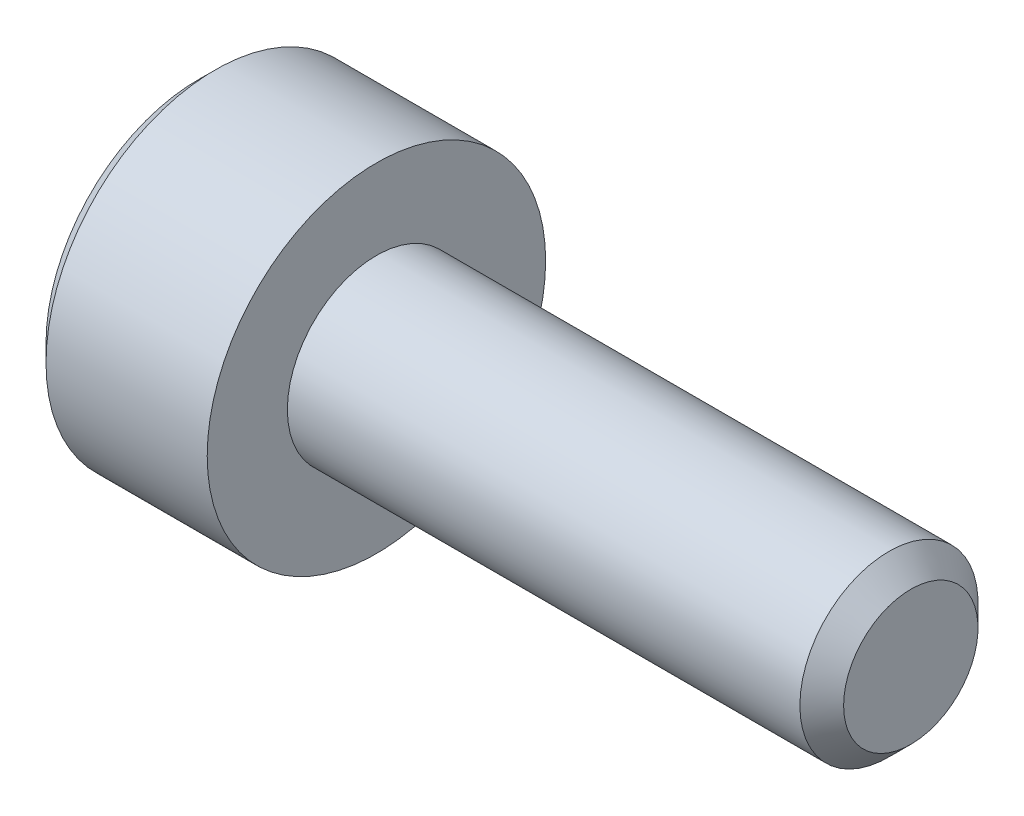
ISO-10303-21;
HEADER;
FILE_DESCRIPTION(('STEP AP214'),'2;1');
FILE_NAME('part.step','',(''),(''),'','','');
FILE_SCHEMA(('AUTOMOTIVE_DESIGN { 1 0 10303 214 1 1 1 1 }'));
ENDSEC;
DATA;
#1=APPLICATION_CONTEXT('core data for automotive mechanical design processes');
#2=APPLICATION_PROTOCOL_DEFINITION('international standard','automotive_design',2000,#1);
#3=PRODUCT_CONTEXT('',#1,'mechanical');
#4=PRODUCT('Part','Part','',(#3));
#5=PRODUCT_RELATED_PRODUCT_CATEGORY('part','',(#4));
#6=PRODUCT_DEFINITION_FORMATION('','',#4);
#7=PRODUCT_DEFINITION_CONTEXT('part definition',#1,'design');
#8=PRODUCT_DEFINITION('design','',#6,#7);
#9=PRODUCT_DEFINITION_SHAPE('','',#8);
#10=(LENGTH_UNIT() NAMED_UNIT(*) SI_UNIT(.MILLI.,.METRE.));
#11=(NAMED_UNIT(*) PLANE_ANGLE_UNIT() SI_UNIT($,.RADIAN.));
#12=(NAMED_UNIT(*) SI_UNIT($,.STERADIAN.) SOLID_ANGLE_UNIT());
#13=UNCERTAINTY_MEASURE_WITH_UNIT(LENGTH_MEASURE(1.E-05),#10,'distance_accuracy_value','');
#14=(GEOMETRIC_REPRESENTATION_CONTEXT(3) GLOBAL_UNCERTAINTY_ASSIGNED_CONTEXT((#13)) GLOBAL_UNIT_ASSIGNED_CONTEXT((#10,
#11,#12)) REPRESENTATION_CONTEXT('',''));
#15=CARTESIAN_POINT('',(0.,0.,0.));
#16=DIRECTION('',(0.,0.,1.));
#17=DIRECTION('',(1.,0.,0.));
#18=AXIS2_PLACEMENT_3D('',#15,#16,#17);
#19=CARTESIAN_POINT('',(-2.,0.,0.));
#20=DIRECTION('',(1.,0.,0.));
#21=DIRECTION('',(0.,0.,-1.));
#22=AXIS2_PLACEMENT_3D('',#19,#20,#21);
#23=PLANE('',#22);
#24=CARTESIAN_POINT('',(-2.,0.,0.));
#25=DIRECTION('',(-1.,0.,0.));
#26=DIRECTION('',(0.,0.,1.));
#27=AXIS2_PLACEMENT_3D('',#24,#25,#26);
#28=CIRCLE('',#27,1.71);
#29=CARTESIAN_POINT('',(-2.,0.,1.71));
#30=VERTEX_POINT('',#29);
#31=EDGE_CURVE('E11',#30,#30,#28,.T.);
#32=ORIENTED_EDGE('',*,*,#31,.T.);
#33=EDGE_LOOP('',(#32));
#34=FACE_BOUND('',#33,.T.);
#35=DIRECTION('',(0.,-1.,0.));
#36=VECTOR('',#35,1.);
#37=CARTESIAN_POINT('',(-2.,0.43301270189222,0.75));
#38=LINE('',#37,#36);
#39=CARTESIAN_POINT('',(-2.,0.43301270189222,0.75));
#40=VERTEX_POINT('',#39);
#41=CARTESIAN_POINT('',(-2.,-0.43301270189222,0.75));
#42=VERTEX_POINT('',#41);
#43=EDGE_CURVE('E52',#40,#42,#38,.T.);
#44=ORIENTED_EDGE('',*,*,#43,.T.);
#45=DIRECTION('',(0.,-0.500000000000001,-0.866025403784438));
#46=VECTOR('',#45,1.);
#47=CARTESIAN_POINT('',(-2.,-0.43301270189222,0.75));
#48=LINE('',#47,#46);
#49=CARTESIAN_POINT('',(-2.,-0.86602540378444,0.));
#50=VERTEX_POINT('',#49);
#51=EDGE_CURVE('E123',#42,#50,#48,.T.);
#52=ORIENTED_EDGE('',*,*,#51,.T.);
#53=DIRECTION('',(0.,0.500000000000001,-0.866025403784438));
#54=VECTOR('',#53,1.);
#55=CARTESIAN_POINT('',(-2.,-0.86602540378444,0.));
#56=LINE('',#55,#54);
#57=CARTESIAN_POINT('',(-2.,-0.43301270189222,-0.75));
#58=VERTEX_POINT('',#57);
#59=EDGE_CURVE('E126',#50,#58,#56,.T.);
#60=ORIENTED_EDGE('',*,*,#59,.T.);
#61=DIRECTION('',(0.,1.,0.));
#62=VECTOR('',#61,1.);
#63=CARTESIAN_POINT('',(-2.,-0.43301270189222,-0.75));
#64=LINE('',#63,#62);
#65=CARTESIAN_POINT('',(-2.,0.43301270189222,-0.75));
#66=VERTEX_POINT('',#65);
#67=EDGE_CURVE('E129',#58,#66,#64,.T.);
#68=ORIENTED_EDGE('',*,*,#67,.T.);
#69=DIRECTION('',(0.,0.500000000000001,0.866025403784438));
#70=VECTOR('',#69,1.);
#71=CARTESIAN_POINT('',(-2.,0.43301270189222,-0.75));
#72=LINE('',#71,#70);
#73=CARTESIAN_POINT('',(-2.,0.86602540378444,0.));
#74=VERTEX_POINT('',#73);
#75=EDGE_CURVE('E113',#66,#74,#72,.T.);
#76=ORIENTED_EDGE('',*,*,#75,.T.);
#77=DIRECTION('',(0.,-0.500000000000001,0.866025403784438));
#78=VECTOR('',#77,1.);
#79=CARTESIAN_POINT('',(-2.,0.86602540378444,0.));
#80=LINE('',#79,#78);
#81=EDGE_CURVE('E132',#74,#40,#80,.T.);
#82=ORIENTED_EDGE('',*,*,#81,.T.);
#83=EDGE_LOOP('',(#44,#52,#60,#68,#76,#82));
#84=FACE_BOUND('',#83,.T.);
#85=ADVANCED_FACE('F38',(#34,#84),#23,.F.);
#86=CARTESIAN_POINT('',(-1.81,0.,0.));
#87=DIRECTION('',(1.,0.,0.));
#88=DIRECTION('',(0.,0.,-1.));
#89=AXIS2_PLACEMENT_3D('',#86,#87,#88);
#90=CONICAL_SURFACE('',#89,1.9,0.785398163397448);
#91=ORIENTED_EDGE('',*,*,#31,.F.);
#92=EDGE_LOOP('',(#91));
#93=FACE_BOUND('',#92,.T.);
#94=CARTESIAN_POINT('',(-1.81,0.,0.));
#95=DIRECTION('',(-1.,0.,0.));
#96=DIRECTION('',(0.,0.,1.));
#97=AXIS2_PLACEMENT_3D('',#94,#95,#96);
#98=CIRCLE('',#97,1.9);
#99=CARTESIAN_POINT('',(-1.81,0.,1.9));
#100=VERTEX_POINT('',#99);
#101=EDGE_CURVE('E45',#100,#100,#98,.T.);
#102=ORIENTED_EDGE('',*,*,#101,.T.);
#103=EDGE_LOOP('',(#102));
#104=FACE_BOUND('',#103,.T.);
#105=ADVANCED_FACE('F157',(#93,#104),#90,.T.);
#106=CARTESIAN_POINT('',(6.,0.,0.));
#107=DIRECTION('',(-1.,0.,0.));
#108=DIRECTION('',(0.,0.,1.));
#109=AXIS2_PLACEMENT_3D('',#106,#107,#108);
#110=CYLINDRICAL_SURFACE('',#109,1.9);
#111=ORIENTED_EDGE('',*,*,#101,.F.);
#112=EDGE_LOOP('',(#111));
#113=FACE_BOUND('',#112,.T.);
#114=CARTESIAN_POINT('',(0.,0.,0.));
#115=DIRECTION('',(-1.,0.,0.));
#116=DIRECTION('',(0.,0.,1.));
#117=AXIS2_PLACEMENT_3D('',#114,#115,#116);
#118=CIRCLE('',#117,1.9);
#119=CARTESIAN_POINT('',(0.,0.,1.9));
#120=VERTEX_POINT('',#119);
#121=EDGE_CURVE('E152',#120,#120,#118,.T.);
#122=ORIENTED_EDGE('',*,*,#121,.T.);
#123=EDGE_LOOP('',(#122));
#124=FACE_BOUND('',#123,.T.);
#125=ADVANCED_FACE('F159',(#113,#124),#110,.T.);
#126=CARTESIAN_POINT('',(0.,1.9,0.));
#127=DIRECTION('',(-1.,0.,0.));
#128=DIRECTION('',(0.,0.,1.));
#129=AXIS2_PLACEMENT_3D('',#126,#127,#128);
#130=PLANE('',#129);
#131=ORIENTED_EDGE('',*,*,#121,.F.);
#132=EDGE_LOOP('',(#131));
#133=FACE_BOUND('',#132,.T.);
#134=CARTESIAN_POINT('',(0.,0.,0.));
#135=DIRECTION('',(-1.,0.,0.));
#136=DIRECTION('',(0.,0.,1.));
#137=AXIS2_PLACEMENT_3D('',#134,#135,#136);
#138=CIRCLE('',#137,1.);
#139=CARTESIAN_POINT('',(0.,0.,1.));
#140=VERTEX_POINT('',#139);
#141=EDGE_CURVE('E149',#140,#140,#138,.T.);
#142=ORIENTED_EDGE('',*,*,#141,.T.);
#143=EDGE_LOOP('',(#142));
#144=FACE_BOUND('',#143,.T.);
#145=ADVANCED_FACE('F162',(#133,#144),#130,.F.);
#146=CARTESIAN_POINT('',(6.,0.,0.));
#147=DIRECTION('',(-1.,0.,0.));
#148=DIRECTION('',(0.,0.,1.));
#149=AXIS2_PLACEMENT_3D('',#146,#147,#148);
#150=CYLINDRICAL_SURFACE('',#149,1.);
#151=ORIENTED_EDGE('',*,*,#141,.F.);
#152=EDGE_LOOP('',(#151));
#153=FACE_BOUND('',#152,.T.);
#154=CARTESIAN_POINT('',(5.7545,0.,0.));
#155=DIRECTION('',(-1.,0.,0.));
#156=DIRECTION('',(0.,0.,1.));
#157=AXIS2_PLACEMENT_3D('',#154,#155,#156);
#158=CIRCLE('',#157,1.);
#159=CARTESIAN_POINT('',(5.7545,0.,1.));
#160=VERTEX_POINT('',#159);
#161=EDGE_CURVE('E146',#160,#160,#158,.T.);
#162=ORIENTED_EDGE('',*,*,#161,.T.);
#163=EDGE_LOOP('',(#162));
#164=FACE_BOUND('',#163,.T.);
#165=ADVANCED_FACE('F168',(#153,#164),#150,.T.);
#166=CARTESIAN_POINT('',(6.,0.,0.));
#167=DIRECTION('',(-1.,0.,0.));
#168=DIRECTION('',(0.,0.,1.));
#169=AXIS2_PLACEMENT_3D('',#166,#167,#168);
#170=CONICAL_SURFACE('',#169,0.7545,0.785398163397448);
#171=ORIENTED_EDGE('',*,*,#161,.F.);
#172=EDGE_LOOP('',(#171));
#173=FACE_BOUND('',#172,.T.);
#174=CARTESIAN_POINT('',(6.,0.,0.));
#175=DIRECTION('',(-1.,0.,0.));
#176=DIRECTION('',(0.,0.,1.));
#177=AXIS2_PLACEMENT_3D('',#174,#175,#176);
#178=CIRCLE('',#177,0.7545);
#179=CARTESIAN_POINT('',(6.,0.,0.7545));
#180=VERTEX_POINT('',#179);
#181=EDGE_CURVE('E143',#180,#180,#178,.T.);
#182=ORIENTED_EDGE('',*,*,#181,.T.);
#183=EDGE_LOOP('',(#182));
#184=FACE_BOUND('',#183,.T.);
#185=ADVANCED_FACE('F174',(#173,#184),#170,.T.);
#186=CARTESIAN_POINT('',(6.,0.7545,0.));
#187=DIRECTION('',(-1.,0.,0.));
#188=DIRECTION('',(0.,0.,1.));
#189=AXIS2_PLACEMENT_3D('',#186,#187,#188);
#190=PLANE('',#189);
#191=ORIENTED_EDGE('',*,*,#181,.F.);
#192=EDGE_LOOP('',(#191));
#193=FACE_BOUND('',#192,.T.);
#194=ADVANCED_FACE('F180',(#193),#190,.F.);
#195=CARTESIAN_POINT('',(-1.2,0.43301270189222,0.75));
#196=DIRECTION('',(0.,0.,-1.));
#197=DIRECTION('',(-1.,0.,0.));
#198=AXIS2_PLACEMENT_3D('',#195,#196,#197);
#199=PLANE('',#198);
#200=ORIENTED_EDGE('',*,*,#43,.F.);
#201=DIRECTION('',(-1.,0.,0.));
#202=VECTOR('',#201,1.);
#203=CARTESIAN_POINT('',(-1.2,0.43301270189222,0.75));
#204=LINE('',#203,#202);
#205=CARTESIAN_POINT('',(-1.2,0.43301270189222,0.75));
#206=VERTEX_POINT('',#205);
#207=EDGE_CURVE('E118',#206,#40,#204,.T.);
#208=ORIENTED_EDGE('',*,*,#207,.F.);
#209=DIRECTION('',(0.,-1.,0.));
#210=VECTOR('',#209,1.);
#211=CARTESIAN_POINT('',(-1.2,0.43301270189222,0.75));
#212=LINE('',#211,#210);
#213=CARTESIAN_POINT('',(-1.2,-0.43301270189222,0.75));
#214=VERTEX_POINT('',#213);
#215=EDGE_CURVE('E135',#206,#214,#212,.T.);
#216=ORIENTED_EDGE('',*,*,#215,.T.);
#217=DIRECTION('',(-1.,0.,0.));
#218=VECTOR('',#217,1.);
#219=CARTESIAN_POINT('',(-1.2,-0.43301270189222,0.75));
#220=LINE('',#219,#218);
#221=EDGE_CURVE('E141',#214,#42,#220,.T.);
#222=ORIENTED_EDGE('',*,*,#221,.T.);
#223=EDGE_LOOP('',(#200,#208,#216,#222));
#224=FACE_BOUND('',#223,.T.);
#225=ADVANCED_FACE('F185',(#224),#199,.T.);
#226=CARTESIAN_POINT('',(-1.2,-0.43301270189222,0.75));
#227=DIRECTION('',(0.,0.866025403784438,-0.500000000000001));
#228=DIRECTION('',(0.,0.500000000000001,0.866025403784438));
#229=AXIS2_PLACEMENT_3D('',#226,#227,#228);
#230=PLANE('',#229);
#231=ORIENTED_EDGE('',*,*,#51,.F.);
#232=ORIENTED_EDGE('',*,*,#221,.F.);
#233=DIRECTION('',(0.,-0.500000000000001,-0.866025403784438));
#234=VECTOR('',#233,1.);
#235=CARTESIAN_POINT('',(-1.2,-0.43301270189222,0.75));
#236=LINE('',#235,#234);
#237=CARTESIAN_POINT('',(-1.2,-0.86602540378444,0.));
#238=VERTEX_POINT('',#237);
#239=EDGE_CURVE('E91',#214,#238,#236,.T.);
#240=ORIENTED_EDGE('',*,*,#239,.T.);
#241=DIRECTION('',(-1.,0.,0.));
#242=VECTOR('',#241,1.);
#243=CARTESIAN_POINT('',(-1.2,-0.86602540378444,0.));
#244=LINE('',#243,#242);
#245=EDGE_CURVE('E139',#238,#50,#244,.T.);
#246=ORIENTED_EDGE('',*,*,#245,.T.);
#247=EDGE_LOOP('',(#231,#232,#240,#246));
#248=FACE_BOUND('',#247,.T.);
#249=ADVANCED_FACE('F190',(#248),#230,.T.);
#250=CARTESIAN_POINT('',(-1.2,-0.86602540378444,0.));
#251=DIRECTION('',(0.,0.866025403784438,0.500000000000001));
#252=DIRECTION('',(0.,-0.500000000000001,0.866025403784438));
#253=AXIS2_PLACEMENT_3D('',#250,#251,#252);
#254=PLANE('',#253);
#255=ORIENTED_EDGE('',*,*,#59,.F.);
#256=ORIENTED_EDGE('',*,*,#245,.F.);
#257=DIRECTION('',(0.,0.500000000000001,-0.866025403784438));
#258=VECTOR('',#257,1.);
#259=CARTESIAN_POINT('',(-1.2,-0.86602540378444,0.));
#260=LINE('',#259,#258);
#261=CARTESIAN_POINT('',(-1.2,-0.43301270189222,-0.75));
#262=VERTEX_POINT('',#261);
#263=EDGE_CURVE('E109',#238,#262,#260,.T.);
#264=ORIENTED_EDGE('',*,*,#263,.T.);
#265=DIRECTION('',(-1.,0.,0.));
#266=VECTOR('',#265,1.);
#267=CARTESIAN_POINT('',(-1.2,-0.43301270189222,-0.75));
#268=LINE('',#267,#266);
#269=EDGE_CURVE('E106',#262,#58,#268,.T.);
#270=ORIENTED_EDGE('',*,*,#269,.T.);
#271=EDGE_LOOP('',(#255,#256,#264,#270));
#272=FACE_BOUND('',#271,.T.);
#273=ADVANCED_FACE('F207',(#272),#254,.T.);
#274=CARTESIAN_POINT('',(-1.2,-0.43301270189222,-0.75));
#275=DIRECTION('',(0.,0.,1.));
#276=DIRECTION('',(1.,0.,0.));
#277=AXIS2_PLACEMENT_3D('',#274,#275,#276);
#278=PLANE('',#277);
#279=ORIENTED_EDGE('',*,*,#67,.F.);
#280=ORIENTED_EDGE('',*,*,#269,.F.);
#281=DIRECTION('',(0.,1.,0.));
#282=VECTOR('',#281,1.);
#283=CARTESIAN_POINT('',(-1.2,-0.43301270189222,-0.75));
#284=LINE('',#283,#282);
#285=CARTESIAN_POINT('',(-1.2,0.43301270189222,-0.75));
#286=VERTEX_POINT('',#285);
#287=EDGE_CURVE('E101',#262,#286,#284,.T.);
#288=ORIENTED_EDGE('',*,*,#287,.T.);
#289=DIRECTION('',(-1.,0.,0.));
#290=VECTOR('',#289,1.);
#291=CARTESIAN_POINT('',(-1.2,0.43301270189222,-0.75));
#292=LINE('',#291,#290);
#293=EDGE_CURVE('E105',#286,#66,#292,.T.);
#294=ORIENTED_EDGE('',*,*,#293,.T.);
#295=EDGE_LOOP('',(#279,#280,#288,#294));
#296=FACE_BOUND('',#295,.T.);
#297=ADVANCED_FACE('F104',(#296),#278,.T.);
#298=CARTESIAN_POINT('',(-1.2,0.43301270189222,-0.75));
#299=DIRECTION('',(0.,-0.866025403784438,0.500000000000001));
#300=DIRECTION('',(0.,-0.500000000000001,-0.866025403784438));
#301=AXIS2_PLACEMENT_3D('',#298,#299,#300);
#302=PLANE('',#301);
#303=ORIENTED_EDGE('',*,*,#75,.F.);
#304=ORIENTED_EDGE('',*,*,#293,.F.);
#305=DIRECTION('',(0.,0.500000000000001,0.866025403784438));
#306=VECTOR('',#305,1.);
#307=CARTESIAN_POINT('',(-1.2,0.43301270189222,-0.75));
#308=LINE('',#307,#306);
#309=CARTESIAN_POINT('',(-1.2,0.86602540378444,0.));
#310=VERTEX_POINT('',#309);
#311=EDGE_CURVE('E108',#286,#310,#308,.T.);
#312=ORIENTED_EDGE('',*,*,#311,.T.);
#313=DIRECTION('',(-1.,0.,0.));
#314=VECTOR('',#313,1.);
#315=CARTESIAN_POINT('',(-1.2,0.86602540378444,0.));
#316=LINE('',#315,#314);
#317=EDGE_CURVE('E82',#310,#74,#316,.T.);
#318=ORIENTED_EDGE('',*,*,#317,.T.);
#319=EDGE_LOOP('',(#303,#304,#312,#318));
#320=FACE_BOUND('',#319,.T.);
#321=ADVANCED_FACE('F111',(#320),#302,.T.);
#322=CARTESIAN_POINT('',(-1.2,0.86602540378444,0.));
#323=DIRECTION('',(0.,-0.866025403784438,-0.500000000000001));
#324=DIRECTION('',(0.,0.500000000000001,-0.866025403784438));
#325=AXIS2_PLACEMENT_3D('',#322,#323,#324);
#326=PLANE('',#325);
#327=ORIENTED_EDGE('',*,*,#81,.F.);
#328=ORIENTED_EDGE('',*,*,#317,.F.);
#329=DIRECTION('',(0.,-0.500000000000001,0.866025403784438));
#330=VECTOR('',#329,1.);
#331=CARTESIAN_POINT('',(-1.2,0.86602540378444,0.));
#332=LINE('',#331,#330);
#333=EDGE_CURVE('E60',#310,#206,#332,.T.);
#334=ORIENTED_EDGE('',*,*,#333,.T.);
#335=ORIENTED_EDGE('',*,*,#207,.T.);
#336=EDGE_LOOP('',(#327,#328,#334,#335));
#337=FACE_BOUND('',#336,.T.);
#338=ADVANCED_FACE('F200',(#337),#326,.T.);
#339=CARTESIAN_POINT('',(-1.2,0.,0.));
#340=DIRECTION('',(1.,0.,0.));
#341=DIRECTION('',(0.,0.,-1.));
#342=AXIS2_PLACEMENT_3D('',#339,#340,#341);
#343=PLANE('',#342);
#344=ORIENTED_EDGE('',*,*,#215,.F.);
#345=ORIENTED_EDGE('',*,*,#333,.F.);
#346=ORIENTED_EDGE('',*,*,#311,.F.);
#347=ORIENTED_EDGE('',*,*,#287,.F.);
#348=ORIENTED_EDGE('',*,*,#263,.F.);
#349=ORIENTED_EDGE('',*,*,#239,.F.);
#350=EDGE_LOOP('',(#344,#345,#346,#347,#348,#349));
#351=FACE_BOUND('',#350,.T.);
#352=ADVANCED_FACE('F116',(#351),#343,.F.);
#353=CLOSED_SHELL('',(#85,#105,#125,#145,#165,#185,#194,#225,#249,#273,#297,#321,#338,#352));
#354=MANIFOLD_SOLID_BREP('B2',#353);
#355=ADVANCED_BREP_SHAPE_REPRESENTATION('',(#18,#354),#14);
#356=SHAPE_DEFINITION_REPRESENTATION(#9,#355);
ENDSEC;
END-ISO-10303-21;
